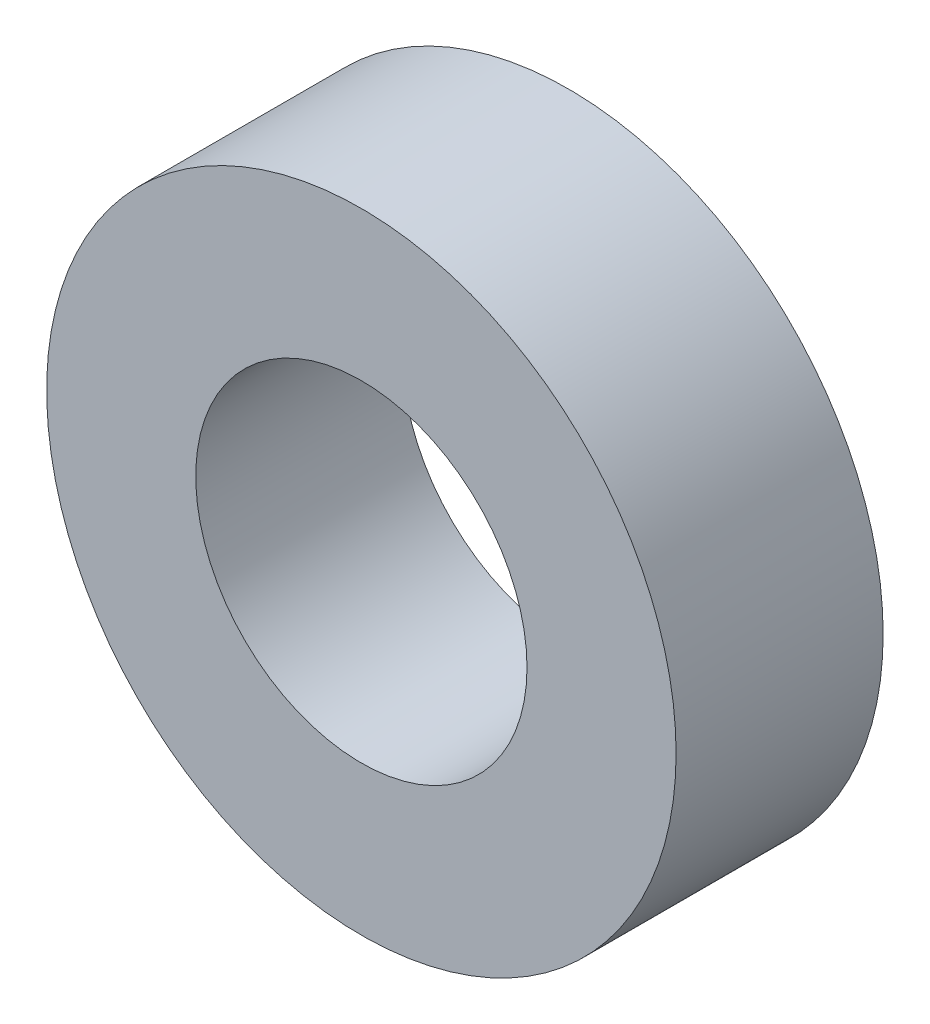
ISO-10303-21;
HEADER;
FILE_DESCRIPTION(('STEP AP214'),'2;1');
FILE_NAME('part.step','',(''),(''),'','','');
FILE_SCHEMA(('AUTOMOTIVE_DESIGN { 1 0 10303 214 1 1 1 1 }'));
ENDSEC;
DATA;
#1=APPLICATION_CONTEXT('core data for automotive mechanical design processes');
#2=APPLICATION_PROTOCOL_DEFINITION('international standard','automotive_design',2000,#1);
#3=PRODUCT_CONTEXT('',#1,'mechanical');
#4=PRODUCT('Part','Part','',(#3));
#5=PRODUCT_RELATED_PRODUCT_CATEGORY('part','',(#4));
#6=PRODUCT_DEFINITION_FORMATION('','',#4);
#7=PRODUCT_DEFINITION_CONTEXT('part definition',#1,'design');
#8=PRODUCT_DEFINITION('design','',#6,#7);
#9=PRODUCT_DEFINITION_SHAPE('','',#8);
#10=(LENGTH_UNIT() NAMED_UNIT(*) SI_UNIT(.MILLI.,.METRE.));
#11=(NAMED_UNIT(*) PLANE_ANGLE_UNIT() SI_UNIT($,.RADIAN.));
#12=(NAMED_UNIT(*) SI_UNIT($,.STERADIAN.) SOLID_ANGLE_UNIT());
#13=UNCERTAINTY_MEASURE_WITH_UNIT(LENGTH_MEASURE(1.E-05),#10,'distance_accuracy_value','');
#14=(GEOMETRIC_REPRESENTATION_CONTEXT(3) GLOBAL_UNCERTAINTY_ASSIGNED_CONTEXT((#13)) GLOBAL_UNIT_ASSIGNED_CONTEXT((#10,
#11,#12)) REPRESENTATION_CONTEXT('',''));
#15=CARTESIAN_POINT('',(0.,0.,0.));
#16=DIRECTION('',(0.,0.,1.));
#17=DIRECTION('',(1.,0.,0.));
#18=AXIS2_PLACEMENT_3D('',#15,#16,#17);
#19=CARTESIAN_POINT('',(0.,0.,-1.5625));
#20=DIRECTION('',(0.,0.,1.));
#21=DIRECTION('',(1.,0.,0.));
#22=AXIS2_PLACEMENT_3D('',#19,#20,#21);
#23=CYLINDRICAL_SURFACE('',#22,2.5);
#24=CARTESIAN_POINT('',(0.,0.,1.5625));
#25=DIRECTION('',(0.,0.,1.));
#26=DIRECTION('',(1.,0.,0.));
#27=AXIS2_PLACEMENT_3D('',#24,#25,#26);
#28=CIRCLE('',#27,2.5);
#29=CARTESIAN_POINT('',(2.5,0.,1.5625));
#30=VERTEX_POINT('',#29);
#31=EDGE_CURVE('E10',#30,#30,#28,.T.);
#32=ORIENTED_EDGE('',*,*,#31,.T.);
#33=EDGE_LOOP('',(#32));
#34=FACE_BOUND('',#33,.T.);
#35=CARTESIAN_POINT('',(0.,0.,-1.5625));
#36=DIRECTION('',(0.,0.,1.));
#37=DIRECTION('',(1.,0.,0.));
#38=AXIS2_PLACEMENT_3D('',#35,#36,#37);
#39=CIRCLE('',#38,2.5);
#40=CARTESIAN_POINT('',(2.5,0.,-1.5625));
#41=VERTEX_POINT('',#40);
#42=EDGE_CURVE('E44',#41,#41,#39,.T.);
#43=ORIENTED_EDGE('',*,*,#42,.F.);
#44=EDGE_LOOP('',(#43));
#45=FACE_BOUND('',#44,.T.);
#46=ADVANCED_FACE('F30',(#34,#45),#23,.F.);
#47=CARTESIAN_POINT('',(2.5,0.,1.5625));
#48=DIRECTION('',(0.,0.,1.));
#49=DIRECTION('',(1.,0.,0.));
#50=AXIS2_PLACEMENT_3D('',#47,#48,#49);
#51=PLANE('',#50);
#52=CARTESIAN_POINT('',(0.,0.,1.5625));
#53=DIRECTION('',(0.,0.,1.));
#54=DIRECTION('',(1.,0.,0.));
#55=AXIS2_PLACEMENT_3D('',#52,#53,#54);
#56=CIRCLE('',#55,4.75);
#57=CARTESIAN_POINT('',(4.75,0.,1.5625));
#58=VERTEX_POINT('',#57);
#59=EDGE_CURVE('E36',#58,#58,#56,.T.);
#60=ORIENTED_EDGE('',*,*,#59,.T.);
#61=EDGE_LOOP('',(#60));
#62=FACE_BOUND('',#61,.T.);
#63=ORIENTED_EDGE('',*,*,#31,.F.);
#64=EDGE_LOOP('',(#63));
#65=FACE_BOUND('',#64,.T.);
#66=ADVANCED_FACE('F54',(#62,#65),#51,.T.);
#67=CARTESIAN_POINT('',(0.,0.,-1.5625));
#68=DIRECTION('',(0.,0.,1.));
#69=DIRECTION('',(1.,0.,0.));
#70=AXIS2_PLACEMENT_3D('',#67,#68,#69);
#71=CYLINDRICAL_SURFACE('',#70,4.75);
#72=CARTESIAN_POINT('',(0.,0.,-1.5625));
#73=DIRECTION('',(0.,0.,1.));
#74=DIRECTION('',(1.,0.,0.));
#75=AXIS2_PLACEMENT_3D('',#72,#73,#74);
#76=CIRCLE('',#75,4.75);
#77=CARTESIAN_POINT('',(4.75,0.,-1.5625));
#78=VERTEX_POINT('',#77);
#79=EDGE_CURVE('E40',#78,#78,#76,.T.);
#80=ORIENTED_EDGE('',*,*,#79,.T.);
#81=EDGE_LOOP('',(#80));
#82=FACE_BOUND('',#81,.T.);
#83=ORIENTED_EDGE('',*,*,#59,.F.);
#84=EDGE_LOOP('',(#83));
#85=FACE_BOUND('',#84,.T.);
#86=ADVANCED_FACE('F58',(#82,#85),#71,.T.);
#87=CARTESIAN_POINT('',(4.75,0.,-1.5625));
#88=DIRECTION('',(0.,0.,-1.));
#89=DIRECTION('',(-1.,0.,0.));
#90=AXIS2_PLACEMENT_3D('',#87,#88,#89);
#91=PLANE('',#90);
#92=ORIENTED_EDGE('',*,*,#42,.T.);
#93=EDGE_LOOP('',(#92));
#94=FACE_BOUND('',#93,.T.);
#95=ORIENTED_EDGE('',*,*,#79,.F.);
#96=EDGE_LOOP('',(#95));
#97=FACE_BOUND('',#96,.T.);
#98=ADVANCED_FACE('F50',(#94,#97),#91,.T.);
#99=CLOSED_SHELL('',(#46,#66,#86,#98));
#100=MANIFOLD_SOLID_BREP('B2',#99);
#101=ADVANCED_BREP_SHAPE_REPRESENTATION('',(#18,#100),#14);
#102=SHAPE_DEFINITION_REPRESENTATION(#9,#101);
ENDSEC;
END-ISO-10303-21;
